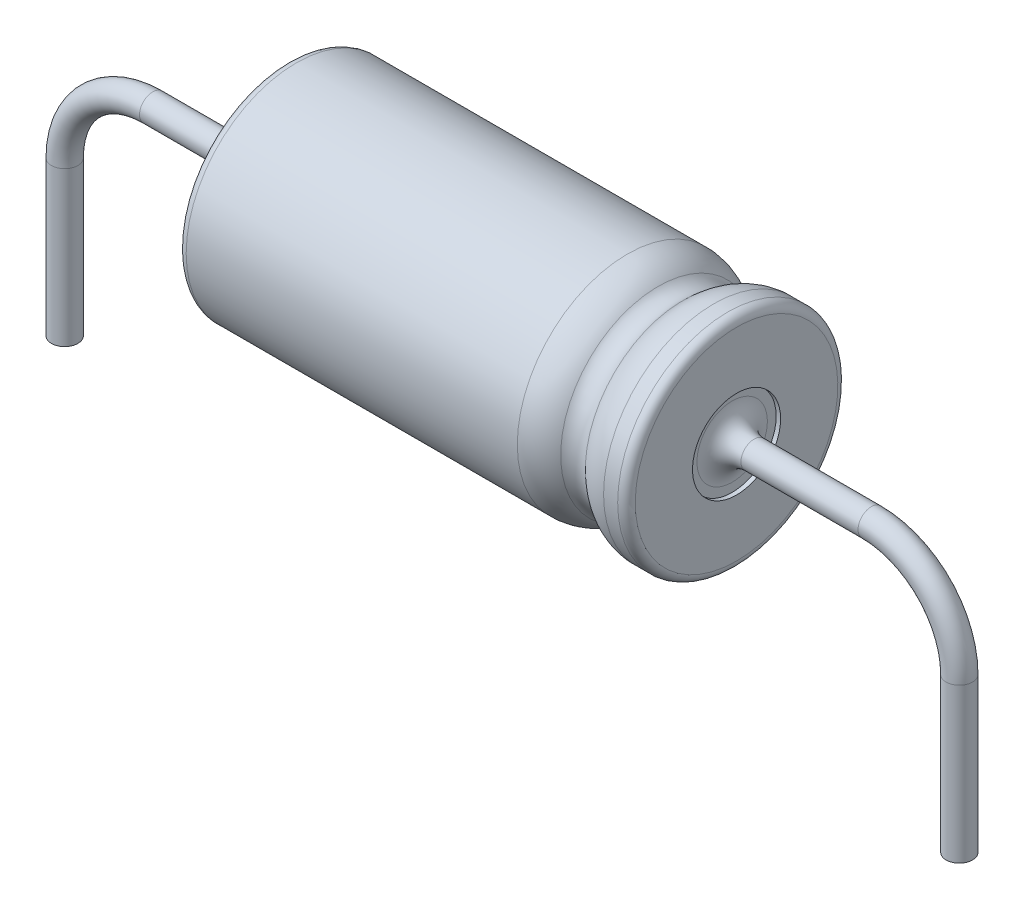
ISO-10303-21;
HEADER;
FILE_DESCRIPTION(('STEP AP214'),'2;1');
FILE_NAME('part.step','',(''),(''),'','','');
FILE_SCHEMA(('AUTOMOTIVE_DESIGN { 1 0 10303 214 1 1 1 1 }'));
ENDSEC;
DATA;
#1=APPLICATION_CONTEXT('core data for automotive mechanical design processes');
#2=APPLICATION_PROTOCOL_DEFINITION('international standard','automotive_design',2000,#1);
#3=PRODUCT_CONTEXT('',#1,'mechanical');
#4=PRODUCT('Part','Part','',(#3));
#5=PRODUCT_RELATED_PRODUCT_CATEGORY('part','',(#4));
#6=PRODUCT_DEFINITION_FORMATION('','',#4);
#7=PRODUCT_DEFINITION_CONTEXT('part definition',#1,'design');
#8=PRODUCT_DEFINITION('design','',#6,#7);
#9=PRODUCT_DEFINITION_SHAPE('','',#8);
#10=(LENGTH_UNIT() NAMED_UNIT(*) SI_UNIT(.MILLI.,.METRE.));
#11=(NAMED_UNIT(*) PLANE_ANGLE_UNIT() SI_UNIT($,.RADIAN.));
#12=(NAMED_UNIT(*) SI_UNIT($,.STERADIAN.) SOLID_ANGLE_UNIT());
#13=UNCERTAINTY_MEASURE_WITH_UNIT(LENGTH_MEASURE(1.E-05),#10,'distance_accuracy_value','');
#14=(GEOMETRIC_REPRESENTATION_CONTEXT(3) GLOBAL_UNCERTAINTY_ASSIGNED_CONTEXT((#13)) GLOBAL_UNIT_ASSIGNED_CONTEXT((#10,
#11,#12)) REPRESENTATION_CONTEXT('',''));
#15=CARTESIAN_POINT('',(0.,0.,0.));
#16=DIRECTION('',(0.,0.,1.));
#17=DIRECTION('',(1.,0.,0.));
#18=AXIS2_PLACEMENT_3D('',#15,#16,#17);
#19=CARTESIAN_POINT('',(-5.06000004,2.5,0.));
#20=DIRECTION('',(1.,0.,0.));
#21=DIRECTION('',(0.,1.,0.));
#22=AXIS2_PLACEMENT_3D('',#19,#20,#21);
#23=CYLINDRICAL_SURFACE('',#22,2.5);
#24=CARTESIAN_POINT('',(-15.06000004,2.49999999999999,0.));
#25=DIRECTION('',(1.,0.,0.));
#26=DIRECTION('',(0.,1.,0.));
#27=AXIS2_PLACEMENT_3D('',#24,#25,#26);
#28=CIRCLE('',#27,2.5);
#29=CARTESIAN_POINT('',(-15.06000004,5.,0.));
#30=VERTEX_POINT('',#29);
#31=EDGE_CURVE('E62',#30,#30,#28,.T.);
#32=ORIENTED_EDGE('',*,*,#31,.T.);
#33=EDGE_LOOP('',(#32));
#34=FACE_BOUND('',#33,.T.);
#35=CARTESIAN_POINT('',(-7.53983709711191,2.5,0.));
#36=DIRECTION('',(1.,0.,0.));
#37=DIRECTION('',(0.,0.,-1.));
#38=AXIS2_PLACEMENT_3D('',#35,#36,#37);
#39=CIRCLE('',#38,2.5);
#40=CARTESIAN_POINT('',(-7.53983709711191,2.5,-2.5));
#41=VERTEX_POINT('',#40);
#42=EDGE_CURVE('E114',#41,#41,#39,.T.);
#43=ORIENTED_EDGE('',*,*,#42,.F.);
#44=EDGE_LOOP('',(#43));
#45=FACE_BOUND('',#44,.T.);
#46=ADVANCED_FACE('F30',(#34,#45),#23,.T.);
#47=CARTESIAN_POINT('',(-15.16000004,2.49999999999999,0.));
#48=DIRECTION('',(-1.,0.,0.));
#49=DIRECTION('',(0.,-1.,0.));
#50=AXIS2_PLACEMENT_3D('',#47,#48,#49);
#51=PLANE('',#50);
#52=CARTESIAN_POINT('',(-15.16000004,2.5,0.));
#53=DIRECTION('',(-1.,0.,0.));
#54=DIRECTION('',(0.,-1.,0.));
#55=AXIS2_PLACEMENT_3D('',#52,#53,#54);
#56=CIRCLE('',#55,0.8);
#57=CARTESIAN_POINT('',(-15.16000004,1.7,0.));
#58=VERTEX_POINT('',#57);
#59=EDGE_CURVE('E46',#58,#58,#56,.F.);
#60=ORIENTED_EDGE('',*,*,#59,.T.);
#61=EDGE_LOOP('',(#60));
#62=FACE_BOUND('',#61,.T.);
#63=CARTESIAN_POINT('',(-15.16000004,2.49999999999999,0.));
#64=DIRECTION('',(-1.,0.,0.));
#65=DIRECTION('',(0.,-1.,0.));
#66=AXIS2_PLACEMENT_3D('',#63,#64,#65);
#67=CIRCLE('',#66,1.);
#68=CARTESIAN_POINT('',(-15.16000004,1.49999999999999,0.));
#69=VERTEX_POINT('',#68);
#70=EDGE_CURVE('E78',#69,#69,#67,.T.);
#71=ORIENTED_EDGE('',*,*,#70,.T.);
#72=EDGE_LOOP('',(#71));
#73=FACE_BOUND('',#72,.T.);
#74=ADVANCED_FACE('F121',(#62,#73),#51,.T.);
#75=CARTESIAN_POINT('',(-15.26000004,5.,0.));
#76=DIRECTION('',(1.,0.,0.));
#77=DIRECTION('',(0.,1.,0.));
#78=AXIS2_PLACEMENT_3D('',#75,#76,#77);
#79=PLANE('',#78);
#80=CARTESIAN_POINT('',(-15.26000004,2.49999999999999,0.));
#81=DIRECTION('',(1.,0.,0.));
#82=DIRECTION('',(0.,1.,0.));
#83=AXIS2_PLACEMENT_3D('',#80,#81,#82);
#84=CIRCLE('',#83,2.3);
#85=CARTESIAN_POINT('',(-15.26000004,4.8,0.));
#86=VERTEX_POINT('',#85);
#87=EDGE_CURVE('E51',#86,#86,#84,.F.);
#88=ORIENTED_EDGE('',*,*,#87,.T.);
#89=EDGE_LOOP('',(#88));
#90=FACE_BOUND('',#89,.T.);
#91=CARTESIAN_POINT('',(-15.26000004,2.49999999999999,0.));
#92=DIRECTION('',(-1.,0.,0.));
#93=DIRECTION('',(0.,-1.,0.));
#94=AXIS2_PLACEMENT_3D('',#91,#92,#93);
#95=CIRCLE('',#94,1.);
#96=CARTESIAN_POINT('',(-15.26000004,1.49999999999999,0.));
#97=VERTEX_POINT('',#96);
#98=EDGE_CURVE('E81',#97,#97,#95,.T.);
#99=ORIENTED_EDGE('',*,*,#98,.F.);
#100=EDGE_LOOP('',(#99));
#101=FACE_BOUND('',#100,.T.);
#102=ADVANCED_FACE('F128',(#90,#101),#79,.F.);
#103=CARTESIAN_POINT('',(-15.16000004,2.49999999999999,0.));
#104=DIRECTION('',(-1.,0.,0.));
#105=DIRECTION('',(0.,-1.,0.));
#106=AXIS2_PLACEMENT_3D('',#103,#104,#105);
#107=CYLINDRICAL_SURFACE('',#106,1.);
#108=ORIENTED_EDGE('',*,*,#70,.F.);
#109=EDGE_LOOP('',(#108));
#110=FACE_BOUND('',#109,.T.);
#111=ORIENTED_EDGE('',*,*,#98,.T.);
#112=EDGE_LOOP('',(#111));
#113=FACE_BOUND('',#112,.T.);
#114=ADVANCED_FACE('F176',(#110,#113),#107,.F.);
#115=CARTESIAN_POINT('',(-15.06000004,2.49999999999999,0.));
#116=DIRECTION('',(1.,0.,0.));
#117=DIRECTION('',(0.,1.,0.));
#118=AXIS2_PLACEMENT_3D('',#115,#116,#117);
#119=TOROIDAL_SURFACE('',#118,2.3,0.2);
#120=ORIENTED_EDGE('',*,*,#87,.F.);
#121=EDGE_LOOP('',(#120));
#122=FACE_BOUND('',#121,.T.);
#123=ORIENTED_EDGE('',*,*,#31,.F.);
#124=EDGE_LOOP('',(#123));
#125=FACE_BOUND('',#124,.T.);
#126=ADVANCED_FACE('F181',(#122,#125),#119,.T.);
#127=CARTESIAN_POINT('',(-4.54000004,2.5,0.));
#128=DIRECTION('',(-1.,0.,0.));
#129=DIRECTION('',(0.,-1.,0.));
#130=AXIS2_PLACEMENT_3D('',#127,#128,#129);
#131=CYLINDRICAL_SURFACE('',#130,0.3);
#132=CARTESIAN_POINT('',(-15.66000004,2.5,0.));
#133=DIRECTION('',(-1.,0.,0.));
#134=DIRECTION('',(0.,-1.,0.));
#135=AXIS2_PLACEMENT_3D('',#132,#133,#134);
#136=CIRCLE('',#135,0.3);
#137=CARTESIAN_POINT('',(-15.66000004,2.2,0.));
#138=VERTEX_POINT('',#137);
#139=EDGE_CURVE('E42',#138,#138,#136,.T.);
#140=ORIENTED_EDGE('',*,*,#139,.T.);
#141=EDGE_LOOP('',(#140));
#142=FACE_BOUND('',#141,.T.);
#143=CARTESIAN_POINT('',(-18.32000008,2.5,0.));
#144=DIRECTION('',(1.,0.,0.));
#145=DIRECTION('',(0.,1.,0.));
#146=AXIS2_PLACEMENT_3D('',#143,#144,#145);
#147=CIRCLE('',#146,0.3);
#148=CARTESIAN_POINT('',(-18.32000008,2.8,0.));
#149=VERTEX_POINT('',#148);
#150=EDGE_CURVE('E102',#149,#149,#147,.T.);
#151=ORIENTED_EDGE('',*,*,#150,.T.);
#152=EDGE_LOOP('',(#151));
#153=FACE_BOUND('',#152,.T.);
#154=ADVANCED_FACE('F190',(#142,#153),#131,.T.);
#155=CARTESIAN_POINT('',(-15.66000004,2.5,0.));
#156=DIRECTION('',(-1.,0.,0.));
#157=DIRECTION('',(0.,-1.,0.));
#158=AXIS2_PLACEMENT_3D('',#155,#156,#157);
#159=TOROIDAL_SURFACE('',#158,0.8,0.5);
#160=ORIENTED_EDGE('',*,*,#139,.F.);
#161=EDGE_LOOP('',(#160));
#162=FACE_BOUND('',#161,.T.);
#163=ORIENTED_EDGE('',*,*,#59,.F.);
#164=EDGE_LOOP('',(#163));
#165=FACE_BOUND('',#164,.T.);
#166=ADVANCED_FACE('F196',(#162,#165),#159,.F.);
#167=CARTESIAN_POINT('',(-20.32000008,0.5,0.));
#168=DIRECTION('',(0.,-1.,0.));
#169=DIRECTION('',(0.,0.,-1.));
#170=AXIS2_PLACEMENT_3D('',#167,#168,#169);
#171=CYLINDRICAL_SURFACE('',#170,0.3);
#172=CARTESIAN_POINT('',(-20.32000008,0.5,0.));
#173=DIRECTION('',(0.,1.,0.));
#174=DIRECTION('',(-1.,0.,0.));
#175=AXIS2_PLACEMENT_3D('',#172,#173,#174);
#176=CIRCLE('',#175,0.3);
#177=CARTESIAN_POINT('',(-20.62000008,0.500000000000001,0.));
#178=VERTEX_POINT('',#177);
#179=EDGE_CURVE('E99',#178,#178,#176,.T.);
#180=ORIENTED_EDGE('',*,*,#179,.F.);
#181=EDGE_LOOP('',(#180));
#182=FACE_BOUND('',#181,.T.);
#183=CARTESIAN_POINT('',(-20.32000008,-3.,0.));
#184=DIRECTION('',(0.,1.,0.));
#185=DIRECTION('',(-1.,0.,0.));
#186=AXIS2_PLACEMENT_3D('',#183,#184,#185);
#187=CIRCLE('',#186,0.3);
#188=CARTESIAN_POINT('',(-20.62000008,-3.,0.));
#189=VERTEX_POINT('',#188);
#190=EDGE_CURVE('E96',#189,#189,#187,.T.);
#191=ORIENTED_EDGE('',*,*,#190,.T.);
#192=EDGE_LOOP('',(#191));
#193=FACE_BOUND('',#192,.T.);
#194=ADVANCED_FACE('F202',(#182,#193),#171,.T.);
#195=CARTESIAN_POINT('',(-18.32000008,0.5,0.));
#196=DIRECTION('',(0.,0.,1.));
#197=DIRECTION('',(1.,0.,0.));
#198=AXIS2_PLACEMENT_3D('',#195,#196,#197);
#199=TOROIDAL_SURFACE('',#198,2.,0.3);
#200=CARTESIAN_POINT('',(-18.32000008,0.5,0.));
#201=DIRECTION('',(0.,0.,1.));
#202=DIRECTION('',(1.,0.,0.));
#203=AXIS2_PLACEMENT_3D('',#200,#201,#202);
#204=CIRCLE('',#203,2.3);
#205=EDGE_CURVE('',#149,#178,#204,.T.);
#206=ORIENTED_EDGE('',*,*,#150,.F.);
#207=ORIENTED_EDGE('',*,*,#179,.T.);
#208=ORIENTED_EDGE('',*,*,#205,.T.);
#209=ORIENTED_EDGE('',*,*,#205,.F.);
#210=EDGE_LOOP('',(#206,#208,#207,#209));
#211=FACE_BOUND('',#210,.T.);
#212=ADVANCED_FACE('F207',(#211),#199,.T.);
#213=CARTESIAN_POINT('',(-20.32000008,-3.,0.));
#214=DIRECTION('',(0.,-1.,0.));
#215=DIRECTION('',(-1.,0.,0.));
#216=AXIS2_PLACEMENT_3D('',#213,#214,#215);
#217=PLANE('',#216);
#218=ORIENTED_EDGE('',*,*,#190,.F.);
#219=EDGE_LOOP('',(#218));
#220=FACE_BOUND('',#219,.T.);
#221=ADVANCED_FACE('F220',(#220),#217,.T.);
#222=CARTESIAN_POINT('',(-7.53983709711191,2.5,0.));
#223=DIRECTION('',(1.,0.,0.));
#224=DIRECTION('',(0.,0.,-1.));
#225=AXIS2_PLACEMENT_3D('',#222,#223,#224);
#226=TOROIDAL_SURFACE('',#225,1.5,1.);
#227=CARTESIAN_POINT('',(-6.83998317649418,2.5,0.));
#228=DIRECTION('',(1.,0.,0.));
#229=DIRECTION('',(0.,0.,-1.));
#230=AXIS2_PLACEMENT_3D('',#227,#228,#229);
#231=CIRCLE('',#230,2.214286);
#232=CARTESIAN_POINT('',(-6.83998317649418,2.5,-2.214286));
#233=VERTEX_POINT('',#232);
#234=EDGE_CURVE('E105',#233,#233,#231,.T.);
#235=ORIENTED_EDGE('',*,*,#234,.F.);
#236=EDGE_LOOP('',(#235));
#237=FACE_BOUND('',#236,.T.);
#238=ORIENTED_EDGE('',*,*,#42,.T.);
#239=EDGE_LOOP('',(#238));
#240=FACE_BOUND('',#239,.T.);
#241=ADVANCED_FACE('F118',(#237,#240),#226,.T.);
#242=CARTESIAN_POINT('',(-6.56004160824709,2.5,0.));
#243=DIRECTION('',(1.,0.,0.));
#244=DIRECTION('',(0.,0.,-1.));
#245=AXIS2_PLACEMENT_3D('',#242,#243,#244);
#246=TOROIDAL_SURFACE('',#245,2.5000004,0.4);
#247=CARTESIAN_POINT('',(-6.28010004,2.5,0.));
#248=DIRECTION('',(1.,0.,0.));
#249=DIRECTION('',(0.,0.,-1.));
#250=AXIS2_PLACEMENT_3D('',#247,#248,#249);
#251=CIRCLE('',#250,2.214286);
#252=CARTESIAN_POINT('',(-6.28010004,2.5,-2.214286));
#253=VERTEX_POINT('',#252);
#254=EDGE_CURVE('E108',#253,#253,#251,.T.);
#255=ORIENTED_EDGE('',*,*,#254,.F.);
#256=EDGE_LOOP('',(#255));
#257=FACE_BOUND('',#256,.T.);
#258=ORIENTED_EDGE('',*,*,#234,.T.);
#259=EDGE_LOOP('',(#258));
#260=FACE_BOUND('',#259,.T.);
#261=ADVANCED_FACE('F231',(#257,#260),#246,.F.);
#262=CARTESIAN_POINT('',(-5.58024611938228,2.5,0.));
#263=DIRECTION('',(1.,0.,0.));
#264=DIRECTION('',(0.,0.,-1.));
#265=AXIS2_PLACEMENT_3D('',#262,#263,#264);
#266=TOROIDAL_SURFACE('',#265,1.5,0.999999999999999);
#267=CARTESIAN_POINT('',(-5.58024611938228,2.5,0.));
#268=DIRECTION('',(1.,0.,0.));
#269=DIRECTION('',(0.,0.,-1.));
#270=AXIS2_PLACEMENT_3D('',#267,#268,#269);
#271=CIRCLE('',#270,2.5);
#272=CARTESIAN_POINT('',(-5.58024611938228,2.5,-2.5));
#273=VERTEX_POINT('',#272);
#274=EDGE_CURVE('E111',#273,#273,#271,.T.);
#275=ORIENTED_EDGE('',*,*,#274,.F.);
#276=EDGE_LOOP('',(#275));
#277=FACE_BOUND('',#276,.T.);
#278=ORIENTED_EDGE('',*,*,#254,.T.);
#279=EDGE_LOOP('',(#278));
#280=FACE_BOUND('',#279,.T.);
#281=ADVANCED_FACE('F240',(#277,#280),#266,.T.);
#282=CARTESIAN_POINT('',(0.,-3.,0.));
#283=DIRECTION('',(0.,-1.,0.));
#284=DIRECTION('',(1.,0.,0.));
#285=AXIS2_PLACEMENT_3D('',#282,#283,#284);
#286=PLANE('',#285);
#287=CARTESIAN_POINT('',(0.,-3.,0.));
#288=DIRECTION('',(0.,-1.,0.));
#289=DIRECTION('',(1.,0.,0.));
#290=AXIS2_PLACEMENT_3D('',#287,#288,#289);
#291=CIRCLE('',#290,0.3);
#292=CARTESIAN_POINT('',(0.3,-3.,0.));
#293=VERTEX_POINT('',#292);
#294=EDGE_CURVE('E56',#293,#293,#291,.T.);
#295=ORIENTED_EDGE('',*,*,#294,.T.);
#296=EDGE_LOOP('',(#295));
#297=FACE_BOUND('',#296,.T.);
#298=ADVANCED_FACE('F236',(#297),#286,.T.);
#299=CARTESIAN_POINT('',(0.,0.5,0.));
#300=DIRECTION('',(0.,-1.,0.));
#301=DIRECTION('',(0.,0.,-1.));
#302=AXIS2_PLACEMENT_3D('',#299,#300,#301);
#303=CYLINDRICAL_SURFACE('',#302,0.3);
#304=CARTESIAN_POINT('',(0.,0.5,0.));
#305=DIRECTION('',(0.,-1.,0.));
#306=DIRECTION('',(1.,0.,0.));
#307=AXIS2_PLACEMENT_3D('',#304,#305,#306);
#308=CIRCLE('',#307,0.3);
#309=CARTESIAN_POINT('',(0.3,0.5,0.));
#310=VERTEX_POINT('',#309);
#311=EDGE_CURVE('E90',#310,#310,#308,.T.);
#312=ORIENTED_EDGE('',*,*,#311,.T.);
#313=EDGE_LOOP('',(#312));
#314=FACE_BOUND('',#313,.T.);
#315=ORIENTED_EDGE('',*,*,#294,.F.);
#316=EDGE_LOOP('',(#315));
#317=FACE_BOUND('',#316,.T.);
#318=ADVANCED_FACE('F239',(#314,#317),#303,.T.);
#319=CARTESIAN_POINT('',(-2.,0.5,0.));
#320=DIRECTION('',(0.,0.,-1.));
#321=DIRECTION('',(-1.,0.,0.));
#322=AXIS2_PLACEMENT_3D('',#319,#320,#321);
#323=TOROIDAL_SURFACE('',#322,2.,0.3);
#324=CARTESIAN_POINT('',(-2.,2.5,0.));
#325=DIRECTION('',(1.,0.,0.));
#326=DIRECTION('',(0.,1.,0.));
#327=AXIS2_PLACEMENT_3D('',#324,#325,#326);
#328=CIRCLE('',#327,0.3);
#329=CARTESIAN_POINT('',(-2.,2.8,0.));
#330=VERTEX_POINT('',#329);
#331=EDGE_CURVE('E93',#330,#330,#328,.T.);
#332=CARTESIAN_POINT('',(-2.,0.5,0.));
#333=DIRECTION('',(0.,0.,-1.));
#334=DIRECTION('',(-1.,0.,0.));
#335=AXIS2_PLACEMENT_3D('',#332,#333,#334);
#336=CIRCLE('',#335,2.3);
#337=EDGE_CURVE('',#330,#310,#336,.T.);
#338=ORIENTED_EDGE('',*,*,#331,.T.);
#339=ORIENTED_EDGE('',*,*,#311,.F.);
#340=ORIENTED_EDGE('',*,*,#337,.T.);
#341=ORIENTED_EDGE('',*,*,#337,.F.);
#342=EDGE_LOOP('',(#338,#340,#339,#341));
#343=FACE_BOUND('',#342,.T.);
#344=ADVANCED_FACE('F242',(#343),#323,.T.);
#345=CARTESIAN_POINT('',(-4.66000004,2.5,0.));
#346=DIRECTION('',(1.,0.,0.));
#347=DIRECTION('',(0.,0.,-1.));
#348=AXIS2_PLACEMENT_3D('',#345,#346,#347);
#349=CIRCLE('',#348,0.3);
#350=CARTESIAN_POINT('',(-4.66000004,2.5,-0.3));
#351=VERTEX_POINT('',#350);
#352=EDGE_CURVE('E10',#351,#351,#349,.T.);
#353=ORIENTED_EDGE('',*,*,#352,.T.);
#354=EDGE_LOOP('',(#353));
#355=FACE_BOUND('',#354,.T.);
#356=ORIENTED_EDGE('',*,*,#331,.F.);
#357=EDGE_LOOP('',(#356));
#358=FACE_BOUND('',#357,.T.);
#359=ADVANCED_FACE('F199',(#355,#358),#131,.T.);
#360=CARTESIAN_POINT('',(-4.66000004,2.5,0.));
#361=DIRECTION('',(1.,0.,0.));
#362=DIRECTION('',(0.,0.,-1.));
#363=AXIS2_PLACEMENT_3D('',#360,#361,#362);
#364=TOROIDAL_SURFACE('',#363,0.8,0.5);
#365=ORIENTED_EDGE('',*,*,#352,.F.);
#366=EDGE_LOOP('',(#365));
#367=FACE_BOUND('',#366,.T.);
#368=CARTESIAN_POINT('',(-5.16000004,2.5,0.));
#369=DIRECTION('',(1.,0.,0.));
#370=DIRECTION('',(0.,0.,-1.));
#371=AXIS2_PLACEMENT_3D('',#368,#369,#370);
#372=CIRCLE('',#371,0.8);
#373=CARTESIAN_POINT('',(-5.16000004,2.5,-0.8));
#374=VERTEX_POINT('',#373);
#375=EDGE_CURVE('E38',#374,#374,#372,.F.);
#376=ORIENTED_EDGE('',*,*,#375,.F.);
#377=EDGE_LOOP('',(#376));
#378=FACE_BOUND('',#377,.T.);
#379=ADVANCED_FACE('F32',(#367,#378),#364,.F.);
#380=CARTESIAN_POINT('',(-5.16000004,2.5,0.));
#381=DIRECTION('',(1.,0.,0.));
#382=DIRECTION('',(0.,0.,-1.));
#383=AXIS2_PLACEMENT_3D('',#380,#381,#382);
#384=PLANE('',#383);
#385=ORIENTED_EDGE('',*,*,#375,.T.);
#386=EDGE_LOOP('',(#385));
#387=FACE_BOUND('',#386,.T.);
#388=CARTESIAN_POINT('',(-5.16000004,2.5,0.));
#389=DIRECTION('',(1.,0.,0.));
#390=DIRECTION('',(0.,0.,-1.));
#391=AXIS2_PLACEMENT_3D('',#388,#389,#390);
#392=CIRCLE('',#391,1.);
#393=CARTESIAN_POINT('',(-5.16000004,2.5,-1.));
#394=VERTEX_POINT('',#393);
#395=EDGE_CURVE('E74',#394,#394,#392,.T.);
#396=ORIENTED_EDGE('',*,*,#395,.T.);
#397=EDGE_LOOP('',(#396));
#398=FACE_BOUND('',#397,.T.);
#399=ADVANCED_FACE('F155',(#387,#398),#384,.T.);
#400=CARTESIAN_POINT('',(-5.16000004,2.5,0.));
#401=DIRECTION('',(1.,0.,0.));
#402=DIRECTION('',(0.,0.,-1.));
#403=AXIS2_PLACEMENT_3D('',#400,#401,#402);
#404=CYLINDRICAL_SURFACE('',#403,1.);
#405=ORIENTED_EDGE('',*,*,#395,.F.);
#406=EDGE_LOOP('',(#405));
#407=FACE_BOUND('',#406,.T.);
#408=CARTESIAN_POINT('',(-5.06000004,2.5,0.));
#409=DIRECTION('',(1.,0.,0.));
#410=DIRECTION('',(0.,0.,-1.));
#411=AXIS2_PLACEMENT_3D('',#408,#409,#410);
#412=CIRCLE('',#411,1.);
#413=CARTESIAN_POINT('',(-5.06000004,2.5,-1.));
#414=VERTEX_POINT('',#413);
#415=EDGE_CURVE('E75',#414,#414,#412,.T.);
#416=ORIENTED_EDGE('',*,*,#415,.T.);
#417=EDGE_LOOP('',(#416));
#418=FACE_BOUND('',#417,.T.);
#419=ADVANCED_FACE('F151',(#407,#418),#404,.F.);
#420=CARTESIAN_POINT('',(-5.06000004,5.,0.));
#421=DIRECTION('',(-1.,0.,0.));
#422=DIRECTION('',(0.,-1.,0.));
#423=AXIS2_PLACEMENT_3D('',#420,#421,#422);
#424=PLANE('',#423);
#425=CARTESIAN_POINT('',(-5.06000004,2.5,0.));
#426=DIRECTION('',(-1.,0.,0.));
#427=DIRECTION('',(0.,-1.,0.));
#428=AXIS2_PLACEMENT_3D('',#425,#426,#427);
#429=CIRCLE('',#428,2.3);
#430=CARTESIAN_POINT('',(-5.06000004,0.199999999999995,0.));
#431=VERTEX_POINT('',#430);
#432=EDGE_CURVE('E65',#431,#431,#429,.F.);
#433=ORIENTED_EDGE('',*,*,#432,.T.);
#434=EDGE_LOOP('',(#433));
#435=FACE_BOUND('',#434,.T.);
#436=ORIENTED_EDGE('',*,*,#415,.F.);
#437=EDGE_LOOP('',(#436));
#438=FACE_BOUND('',#437,.T.);
#439=ADVANCED_FACE('F140',(#435,#438),#424,.F.);
#440=CARTESIAN_POINT('',(-5.26000004,2.5,0.));
#441=DIRECTION('',(-1.,0.,0.));
#442=DIRECTION('',(0.,-1.,0.));
#443=AXIS2_PLACEMENT_3D('',#440,#441,#442);
#444=TOROIDAL_SURFACE('',#443,2.3,0.2);
#445=CARTESIAN_POINT('',(-5.26000004,2.5,0.));
#446=DIRECTION('',(-1.,0.,0.));
#447=DIRECTION('',(0.,-1.,0.));
#448=AXIS2_PLACEMENT_3D('',#445,#446,#447);
#449=CIRCLE('',#448,2.5);
#450=CARTESIAN_POINT('',(-5.26000004,0.,0.));
#451=VERTEX_POINT('',#450);
#452=EDGE_CURVE('E59',#451,#451,#449,.T.);
#453=ORIENTED_EDGE('',*,*,#452,.F.);
#454=EDGE_LOOP('',(#453));
#455=FACE_BOUND('',#454,.T.);
#456=ORIENTED_EDGE('',*,*,#432,.F.);
#457=EDGE_LOOP('',(#456));
#458=FACE_BOUND('',#457,.T.);
#459=ADVANCED_FACE('F134',(#455,#458),#444,.T.);
#460=ORIENTED_EDGE('',*,*,#274,.T.);
#461=EDGE_LOOP('',(#460));
#462=FACE_BOUND('',#461,.T.);
#463=ORIENTED_EDGE('',*,*,#452,.T.);
#464=EDGE_LOOP('',(#463));
#465=FACE_BOUND('',#464,.T.);
#466=ADVANCED_FACE('F124',(#462,#465),#23,.T.);
#467=CLOSED_SHELL('',(#46,#74,#102,#114,#126,#154,#166,#194,#212,#221,#241,#261,#281,#298,#318,
#344,#359,#379,#399,#419,#439,#459,#466));
#468=CARTESIAN_POINT('',(-6.06000004,5.,0.));
#469=DIRECTION('',(-1.,0.,0.));
#470=DIRECTION('',(0.,-1.,0.));
#471=AXIS2_PLACEMENT_3D('',#468,#469,#470);
#472=PLANE('',#471);
#473=CARTESIAN_POINT('',(-6.06000004,2.5,0.));
#474=DIRECTION('',(1.,0.,0.));
#475=DIRECTION('',(0.,1.,0.));
#476=AXIS2_PLACEMENT_3D('',#473,#474,#475);
#477=CIRCLE('',#476,1.5);
#478=CARTESIAN_POINT('',(-6.06000004,4.,0.));
#479=VERTEX_POINT('',#478);
#480=EDGE_CURVE('E71',#479,#479,#477,.T.);
#481=ORIENTED_EDGE('',*,*,#480,.F.);
#482=EDGE_LOOP('',(#481));
#483=FACE_BOUND('',#482,.T.);
#484=CARTESIAN_POINT('',(-6.06000004,2.5,0.));
#485=DIRECTION('',(-1.,0.,0.));
#486=DIRECTION('',(0.,-1.,0.));
#487=AXIS2_PLACEMENT_3D('',#484,#485,#486);
#488=CIRCLE('',#487,0.3);
#489=CARTESIAN_POINT('',(-6.06000004,2.2,0.));
#490=VERTEX_POINT('',#489);
#491=EDGE_CURVE('E55',#490,#490,#488,.F.);
#492=ORIENTED_EDGE('',*,*,#491,.T.);
#493=EDGE_LOOP('',(#492));
#494=FACE_BOUND('',#493,.T.);
#495=ADVANCED_FACE('F173',(#483,#494),#472,.T.);
#496=CARTESIAN_POINT('',(-14.26000004,5.,0.));
#497=DIRECTION('',(1.,0.,0.));
#498=DIRECTION('',(0.,1.,0.));
#499=AXIS2_PLACEMENT_3D('',#496,#497,#498);
#500=PLANE('',#499);
#501=CARTESIAN_POINT('',(-14.26000004,2.49999999999999,0.));
#502=DIRECTION('',(1.,0.,0.));
#503=DIRECTION('',(0.,1.,0.));
#504=AXIS2_PLACEMENT_3D('',#501,#502,#503);
#505=CIRCLE('',#504,1.5);
#506=CARTESIAN_POINT('',(-14.26000004,4.,0.));
#507=VERTEX_POINT('',#506);
#508=EDGE_CURVE('E68',#507,#507,#505,.T.);
#509=ORIENTED_EDGE('',*,*,#508,.T.);
#510=EDGE_LOOP('',(#509));
#511=FACE_BOUND('',#510,.T.);
#512=CARTESIAN_POINT('',(-14.26000004,2.5,0.));
#513=DIRECTION('',(1.,0.,0.));
#514=DIRECTION('',(0.,1.,0.));
#515=AXIS2_PLACEMENT_3D('',#512,#513,#514);
#516=CIRCLE('',#515,0.3);
#517=CARTESIAN_POINT('',(-14.26000004,2.8,0.));
#518=VERTEX_POINT('',#517);
#519=EDGE_CURVE('E52',#518,#518,#516,.F.);
#520=ORIENTED_EDGE('',*,*,#519,.T.);
#521=EDGE_LOOP('',(#520));
#522=FACE_BOUND('',#521,.T.);
#523=ADVANCED_FACE('F169',(#511,#522),#500,.T.);
#524=CARTESIAN_POINT('',(-5.06000004,2.5,0.));
#525=DIRECTION('',(1.,0.,0.));
#526=DIRECTION('',(0.,1.,0.));
#527=AXIS2_PLACEMENT_3D('',#524,#525,#526);
#528=CYLINDRICAL_SURFACE('',#527,1.5);
#529=ORIENTED_EDGE('',*,*,#480,.T.);
#530=EDGE_LOOP('',(#529));
#531=FACE_BOUND('',#530,.T.);
#532=ORIENTED_EDGE('',*,*,#508,.F.);
#533=EDGE_LOOP('',(#532));
#534=FACE_BOUND('',#533,.T.);
#535=ADVANCED_FACE('F165',(#531,#534),#528,.F.);
#536=ORIENTED_EDGE('',*,*,#491,.F.);
#537=EDGE_LOOP('',(#536));
#538=FACE_BOUND('',#537,.T.);
#539=ORIENTED_EDGE('',*,*,#519,.F.);
#540=EDGE_LOOP('',(#539));
#541=FACE_BOUND('',#540,.T.);
#542=ADVANCED_FACE('F168',(#538,#541),#131,.T.);
#543=CLOSED_SHELL('',(#495,#523,#535,#542));
#544=ORIENTED_CLOSED_SHELL('',*,#543,.T.);
#545=BREP_WITH_VOIDS('B2',#467,(#544));
#546=ADVANCED_BREP_SHAPE_REPRESENTATION('',(#18,#545),#14);
#547=SHAPE_DEFINITION_REPRESENTATION(#9,#546);
ENDSEC;
END-ISO-10303-21;
